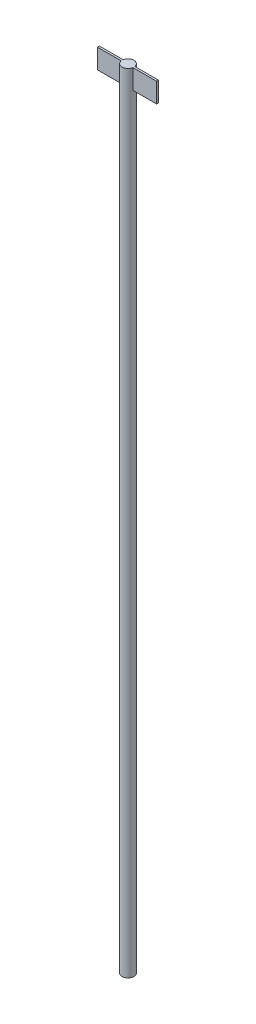
ISO-10303-21;
HEADER;
FILE_DESCRIPTION(('STEP AP214'),'2;1');
FILE_NAME('part.step','',(''),(''),'','','');
FILE_SCHEMA(('AUTOMOTIVE_DESIGN { 1 0 10303 214 1 1 1 1 }'));
ENDSEC;
DATA;
#1=APPLICATION_CONTEXT('core data for automotive mechanical design processes');
#2=APPLICATION_PROTOCOL_DEFINITION('international standard','automotive_design',2000,#1);
#3=PRODUCT_CONTEXT('',#1,'mechanical');
#4=PRODUCT('Part','Part','',(#3));
#5=PRODUCT_RELATED_PRODUCT_CATEGORY('part','',(#4));
#6=PRODUCT_DEFINITION_FORMATION('','',#4);
#7=PRODUCT_DEFINITION_CONTEXT('part definition',#1,'design');
#8=PRODUCT_DEFINITION('design','',#6,#7);
#9=PRODUCT_DEFINITION_SHAPE('','',#8);
#10=(LENGTH_UNIT() NAMED_UNIT(*) SI_UNIT(.MILLI.,.METRE.));
#11=(NAMED_UNIT(*) PLANE_ANGLE_UNIT() SI_UNIT($,.RADIAN.));
#12=(NAMED_UNIT(*) SI_UNIT($,.STERADIAN.) SOLID_ANGLE_UNIT());
#13=UNCERTAINTY_MEASURE_WITH_UNIT(LENGTH_MEASURE(1.E-05),#10,'distance_accuracy_value','');
#14=(GEOMETRIC_REPRESENTATION_CONTEXT(3) GLOBAL_UNCERTAINTY_ASSIGNED_CONTEXT((#13)) GLOBAL_UNIT_ASSIGNED_CONTEXT((#10,
#11,#12)) REPRESENTATION_CONTEXT('',''));
#15=CARTESIAN_POINT('',(0.,0.,0.));
#16=DIRECTION('',(0.,0.,1.));
#17=DIRECTION('',(1.,0.,0.));
#18=AXIS2_PLACEMENT_3D('',#15,#16,#17);
#19=CARTESIAN_POINT('',(0.,100.,0.));
#20=DIRECTION('',(0.,-1.,0.));
#21=DIRECTION('',(0.,0.,-1.));
#22=AXIS2_PLACEMENT_3D('',#19,#20,#21);
#23=CYLINDRICAL_SURFACE('',#22,1.5);
#24=CARTESIAN_POINT('',(0.,95.,0.));
#25=DIRECTION('',(0.,1.,0.));
#26=DIRECTION('',(0.,0.,1.));
#27=AXIS2_PLACEMENT_3D('',#24,#25,#26);
#28=CIRCLE('',#27,1.5);
#29=CARTESIAN_POINT('',(1.47901994577491,95.,0.25));
#30=VERTEX_POINT('',#29);
#31=CARTESIAN_POINT('',(1.47901994577491,95.,-0.25));
#32=VERTEX_POINT('',#31);
#33=EDGE_CURVE('E11',#30,#32,#28,.T.);
#34=ORIENTED_EDGE('',*,*,#33,.F.);
#35=DIRECTION('',(0.,-1.,0.));
#36=VECTOR('',#35,1.);
#37=CARTESIAN_POINT('',(1.47901994577491,100.,0.25));
#38=LINE('',#37,#36);
#39=CARTESIAN_POINT('',(1.47901994577491,100.,0.25));
#40=VERTEX_POINT('',#39);
#41=EDGE_CURVE('E169',#30,#40,#38,.F.);
#42=ORIENTED_EDGE('',*,*,#41,.T.);
#43=CARTESIAN_POINT('',(0.,100.,0.));
#44=DIRECTION('',(0.,1.,0.));
#45=DIRECTION('',(0.,0.,1.));
#46=AXIS2_PLACEMENT_3D('',#43,#44,#45);
#47=CIRCLE('',#46,1.5);
#48=CARTESIAN_POINT('',(-1.47901994577491,100.,0.25));
#49=VERTEX_POINT('',#48);
#50=EDGE_CURVE('E178',#49,#40,#47,.T.);
#51=ORIENTED_EDGE('',*,*,#50,.F.);
#52=DIRECTION('',(0.,-1.,0.));
#53=VECTOR('',#52,1.);
#54=CARTESIAN_POINT('',(-1.47901994577491,100.,0.25));
#55=LINE('',#54,#53);
#56=CARTESIAN_POINT('',(-1.47901994577491,95.,0.25));
#57=VERTEX_POINT('',#56);
#58=EDGE_CURVE('E173',#49,#57,#55,.T.);
#59=ORIENTED_EDGE('',*,*,#58,.T.);
#60=CARTESIAN_POINT('',(-1.47901994577491,95.,-0.25));
#61=VERTEX_POINT('',#60);
#62=EDGE_CURVE('E42',#61,#57,#28,.T.);
#63=ORIENTED_EDGE('',*,*,#62,.F.);
#64=DIRECTION('',(0.,-1.,0.));
#65=VECTOR('',#64,1.);
#66=CARTESIAN_POINT('',(-1.47901994577491,100.,-0.25));
#67=LINE('',#66,#65);
#68=CARTESIAN_POINT('',(-1.47901994577491,100.,-0.25));
#69=VERTEX_POINT('',#68);
#70=EDGE_CURVE('E156',#61,#69,#67,.F.);
#71=ORIENTED_EDGE('',*,*,#70,.T.);
#72=CARTESIAN_POINT('',(1.47901994577491,100.,-0.25));
#73=VERTEX_POINT('',#72);
#74=EDGE_CURVE('E180',#73,#69,#47,.T.);
#75=ORIENTED_EDGE('',*,*,#74,.F.);
#76=DIRECTION('',(0.,-1.,0.));
#77=VECTOR('',#76,1.);
#78=CARTESIAN_POINT('',(1.47901994577491,100.,-0.25));
#79=LINE('',#78,#77);
#80=EDGE_CURVE('E166',#73,#32,#79,.T.);
#81=ORIENTED_EDGE('',*,*,#80,.T.);
#82=EDGE_LOOP('',(#34,#42,#51,#59,#63,#71,#75,#81));
#83=FACE_BOUND('',#82,.T.);
#84=CARTESIAN_POINT('',(0.,-100.,0.));
#85=DIRECTION('',(0.,1.,0.));
#86=DIRECTION('',(0.,0.,1.));
#87=AXIS2_PLACEMENT_3D('',#84,#85,#86);
#88=CIRCLE('',#87,1.5);
#89=CARTESIAN_POINT('',(0.,-100.,1.5));
#90=VERTEX_POINT('',#89);
#91=EDGE_CURVE('E177',#90,#90,#88,.T.);
#92=ORIENTED_EDGE('',*,*,#91,.T.);
#93=EDGE_LOOP('',(#92));
#94=FACE_BOUND('',#93,.T.);
#95=ADVANCED_FACE('F39',(#83,#94),#23,.T.);
#96=CARTESIAN_POINT('',(0.,100.,0.));
#97=DIRECTION('',(0.,1.,0.));
#98=DIRECTION('',(0.,0.,1.));
#99=AXIS2_PLACEMENT_3D('',#96,#97,#98);
#100=PLANE('',#99);
#101=ORIENTED_EDGE('',*,*,#74,.T.);
#102=DIRECTION('',(-1.,0.,0.));
#103=VECTOR('',#102,1.);
#104=CARTESIAN_POINT('',(-7.5,100.,-0.25));
#105=LINE('',#104,#103);
#106=CARTESIAN_POINT('',(-7.5,100.,-0.25));
#107=VERTEX_POINT('',#106);
#108=EDGE_CURVE('E148',#69,#107,#105,.T.);
#109=ORIENTED_EDGE('',*,*,#108,.T.);
#110=DIRECTION('',(0.,0.,1.));
#111=VECTOR('',#110,1.);
#112=CARTESIAN_POINT('',(-7.5,100.,-0.25));
#113=LINE('',#112,#111);
#114=CARTESIAN_POINT('',(-7.5,100.,0.25));
#115=VERTEX_POINT('',#114);
#116=EDGE_CURVE('E151',#107,#115,#113,.T.);
#117=ORIENTED_EDGE('',*,*,#116,.T.);
#118=DIRECTION('',(1.,0.,0.));
#119=VECTOR('',#118,1.);
#120=CARTESIAN_POINT('',(-7.5,100.,0.25));
#121=LINE('',#120,#119);
#122=EDGE_CURVE('E54',#115,#49,#121,.T.);
#123=ORIENTED_EDGE('',*,*,#122,.T.);
#124=ORIENTED_EDGE('',*,*,#50,.T.);
#125=CARTESIAN_POINT('',(7.5,100.,0.25));
#126=VERTEX_POINT('',#125);
#127=EDGE_CURVE('E135',#40,#126,#121,.T.);
#128=ORIENTED_EDGE('',*,*,#127,.T.);
#129=DIRECTION('',(0.,0.,-1.));
#130=VECTOR('',#129,1.);
#131=CARTESIAN_POINT('',(7.5,100.,-0.25));
#132=LINE('',#131,#130);
#133=CARTESIAN_POINT('',(7.5,100.,-0.25));
#134=VERTEX_POINT('',#133);
#135=EDGE_CURVE('E145',#126,#134,#132,.T.);
#136=ORIENTED_EDGE('',*,*,#135,.T.);
#137=EDGE_CURVE('E61',#134,#73,#105,.T.);
#138=ORIENTED_EDGE('',*,*,#137,.T.);
#139=EDGE_LOOP('',(#101,#109,#117,#123,#124,#128,#136,#138));
#140=FACE_BOUND('',#139,.T.);
#141=ADVANCED_FACE('F189',(#140),#100,.T.);
#142=CARTESIAN_POINT('',(0.,-100.,0.));
#143=DIRECTION('',(0.,1.,0.));
#144=DIRECTION('',(0.,0.,1.));
#145=AXIS2_PLACEMENT_3D('',#142,#143,#144);
#146=PLANE('',#145);
#147=ORIENTED_EDGE('',*,*,#91,.F.);
#148=EDGE_LOOP('',(#147));
#149=FACE_BOUND('',#148,.T.);
#150=ADVANCED_FACE('F186',(#149),#146,.F.);
#151=CARTESIAN_POINT('',(-7.5,95.,-0.25));
#152=DIRECTION('',(-1.,0.,0.));
#153=DIRECTION('',(0.,0.,1.));
#154=AXIS2_PLACEMENT_3D('',#151,#152,#153);
#155=PLANE('',#154);
#156=ORIENTED_EDGE('',*,*,#116,.F.);
#157=DIRECTION('',(0.,1.,0.));
#158=VECTOR('',#157,1.);
#159=CARTESIAN_POINT('',(-7.5,95.,-0.25));
#160=LINE('',#159,#158);
#161=CARTESIAN_POINT('',(-7.5,95.,-0.25));
#162=VERTEX_POINT('',#161);
#163=EDGE_CURVE('E114',#162,#107,#160,.T.);
#164=ORIENTED_EDGE('',*,*,#163,.F.);
#165=DIRECTION('',(0.,0.,1.));
#166=VECTOR('',#165,1.);
#167=CARTESIAN_POINT('',(-7.5,95.,-0.25));
#168=LINE('',#167,#166);
#169=CARTESIAN_POINT('',(-7.5,95.,0.25));
#170=VERTEX_POINT('',#169);
#171=EDGE_CURVE('E124',#162,#170,#168,.T.);
#172=ORIENTED_EDGE('',*,*,#171,.T.);
#173=DIRECTION('',(0.,1.,0.));
#174=VECTOR('',#173,1.);
#175=CARTESIAN_POINT('',(-7.5,95.,0.25));
#176=LINE('',#175,#174);
#177=EDGE_CURVE('E157',#170,#115,#176,.T.);
#178=ORIENTED_EDGE('',*,*,#177,.T.);
#179=EDGE_LOOP('',(#156,#164,#172,#178));
#180=FACE_BOUND('',#179,.T.);
#181=ADVANCED_FACE('F188',(#180),#155,.T.);
#182=CARTESIAN_POINT('',(0.,95.,0.));
#183=DIRECTION('',(0.,1.,0.));
#184=DIRECTION('',(0.,0.,1.));
#185=AXIS2_PLACEMENT_3D('',#182,#183,#184);
#186=PLANE('',#185);
#187=DIRECTION('',(-1.,0.,0.));
#188=VECTOR('',#187,1.);
#189=CARTESIAN_POINT('',(-7.5,95.,-0.25));
#190=LINE('',#189,#188);
#191=EDGE_CURVE('E125',#61,#162,#190,.T.);
#192=ORIENTED_EDGE('',*,*,#191,.F.);
#193=ORIENTED_EDGE('',*,*,#62,.T.);
#194=DIRECTION('',(1.,0.,0.));
#195=VECTOR('',#194,1.);
#196=CARTESIAN_POINT('',(-7.5,95.,0.25));
#197=LINE('',#196,#195);
#198=EDGE_CURVE('E115',#170,#57,#197,.T.);
#199=ORIENTED_EDGE('',*,*,#198,.F.);
#200=ORIENTED_EDGE('',*,*,#171,.F.);
#201=EDGE_LOOP('',(#192,#193,#199,#200));
#202=FACE_BOUND('',#201,.T.);
#203=ADVANCED_FACE('F195',(#202),#186,.F.);
#204=CARTESIAN_POINT('',(-7.5,95.,-0.25));
#205=DIRECTION('',(0.,0.,-1.));
#206=DIRECTION('',(-1.,0.,0.));
#207=AXIS2_PLACEMENT_3D('',#204,#205,#206);
#208=PLANE('',#207);
#209=ORIENTED_EDGE('',*,*,#70,.F.);
#210=ORIENTED_EDGE('',*,*,#191,.T.);
#211=ORIENTED_EDGE('',*,*,#163,.T.);
#212=ORIENTED_EDGE('',*,*,#108,.F.);
#213=EDGE_LOOP('',(#209,#210,#211,#212));
#214=FACE_BOUND('',#213,.T.);
#215=ADVANCED_FACE('F225',(#214),#208,.T.);
#216=CARTESIAN_POINT('',(-7.5,95.,0.25));
#217=DIRECTION('',(0.,0.,1.));
#218=DIRECTION('',(1.,0.,0.));
#219=AXIS2_PLACEMENT_3D('',#216,#217,#218);
#220=PLANE('',#219);
#221=ORIENTED_EDGE('',*,*,#58,.F.);
#222=ORIENTED_EDGE('',*,*,#122,.F.);
#223=ORIENTED_EDGE('',*,*,#177,.F.);
#224=ORIENTED_EDGE('',*,*,#198,.T.);
#225=EDGE_LOOP('',(#221,#222,#223,#224));
#226=FACE_BOUND('',#225,.T.);
#227=ADVANCED_FACE('F213',(#226),#220,.T.);
#228=CARTESIAN_POINT('',(7.5,95.,0.25));
#229=VERTEX_POINT('',#228);
#230=EDGE_CURVE('E141',#30,#229,#197,.T.);
#231=ORIENTED_EDGE('',*,*,#230,.F.);
#232=ORIENTED_EDGE('',*,*,#33,.T.);
#233=CARTESIAN_POINT('',(7.5,95.,-0.25));
#234=VERTEX_POINT('',#233);
#235=EDGE_CURVE('E108',#234,#32,#190,.T.);
#236=ORIENTED_EDGE('',*,*,#235,.F.);
#237=DIRECTION('',(0.,0.,-1.));
#238=VECTOR('',#237,1.);
#239=CARTESIAN_POINT('',(7.5,95.,-0.25));
#240=LINE('',#239,#238);
#241=EDGE_CURVE('E121',#229,#234,#240,.T.);
#242=ORIENTED_EDGE('',*,*,#241,.F.);
#243=EDGE_LOOP('',(#231,#232,#236,#242));
#244=FACE_BOUND('',#243,.T.);
#245=ADVANCED_FACE('F120',(#244),#186,.F.);
#246=ORIENTED_EDGE('',*,*,#41,.F.);
#247=ORIENTED_EDGE('',*,*,#230,.T.);
#248=DIRECTION('',(0.,1.,0.));
#249=VECTOR('',#248,1.);
#250=CARTESIAN_POINT('',(7.5,95.,0.25));
#251=LINE('',#250,#249);
#252=EDGE_CURVE('E130',#229,#126,#251,.T.);
#253=ORIENTED_EDGE('',*,*,#252,.T.);
#254=ORIENTED_EDGE('',*,*,#127,.F.);
#255=EDGE_LOOP('',(#246,#247,#253,#254));
#256=FACE_BOUND('',#255,.T.);
#257=ADVANCED_FACE('F216',(#256),#220,.T.);
#258=ORIENTED_EDGE('',*,*,#80,.F.);
#259=ORIENTED_EDGE('',*,*,#137,.F.);
#260=DIRECTION('',(0.,1.,0.));
#261=VECTOR('',#260,1.);
#262=CARTESIAN_POINT('',(7.5,95.,-0.25));
#263=LINE('',#262,#261);
#264=EDGE_CURVE('E105',#234,#134,#263,.T.);
#265=ORIENTED_EDGE('',*,*,#264,.F.);
#266=ORIENTED_EDGE('',*,*,#235,.T.);
#267=EDGE_LOOP('',(#258,#259,#265,#266));
#268=FACE_BOUND('',#267,.T.);
#269=ADVANCED_FACE('F107',(#268),#208,.T.);
#270=CARTESIAN_POINT('',(7.5,95.,-0.25));
#271=DIRECTION('',(1.,0.,0.));
#272=DIRECTION('',(0.,0.,-1.));
#273=AXIS2_PLACEMENT_3D('',#270,#271,#272);
#274=PLANE('',#273);
#275=ORIENTED_EDGE('',*,*,#135,.F.);
#276=ORIENTED_EDGE('',*,*,#252,.F.);
#277=ORIENTED_EDGE('',*,*,#241,.T.);
#278=ORIENTED_EDGE('',*,*,#264,.T.);
#279=EDGE_LOOP('',(#275,#276,#277,#278));
#280=FACE_BOUND('',#279,.T.);
#281=ADVANCED_FACE('F128',(#280),#274,.T.);
#282=CLOSED_SHELL('',(#95,#141,#150,#181,#203,#215,#227,#245,#257,#269,#281));
#283=MANIFOLD_SOLID_BREP('B2',#282);
#284=ADVANCED_BREP_SHAPE_REPRESENTATION('',(#18,#283),#14);
#285=SHAPE_DEFINITION_REPRESENTATION(#9,#284);
ENDSEC;
END-ISO-10303-21;
